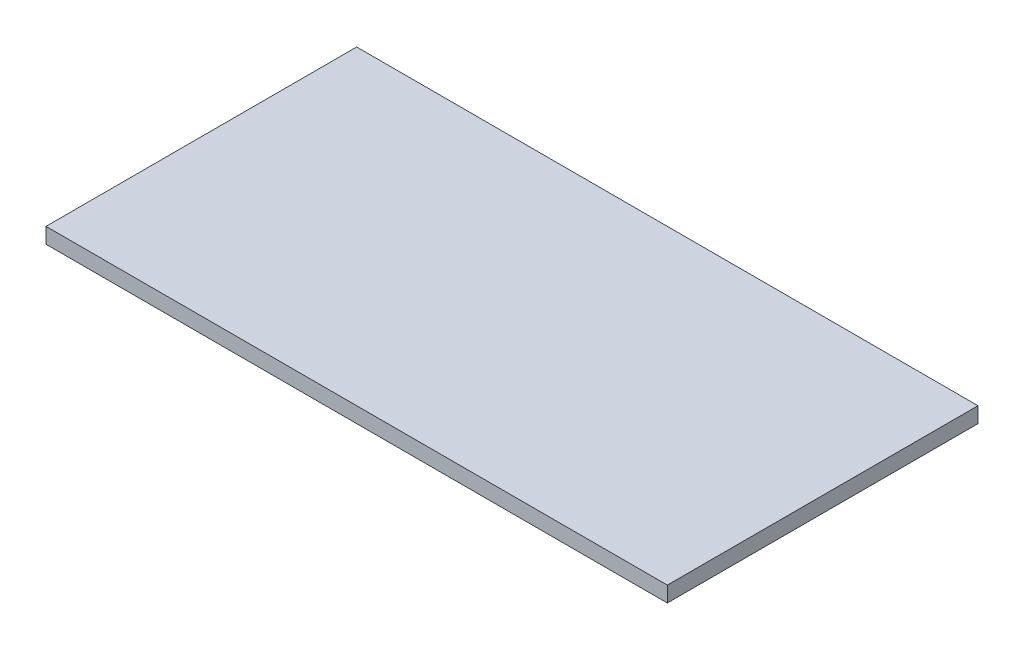
ISO-10303-21;
HEADER;
FILE_DESCRIPTION(('STEP AP214'),'2;1');
FILE_NAME('part.step','',(''),(''),'','','');
FILE_SCHEMA(('AUTOMOTIVE_DESIGN { 1 0 10303 214 1 1 1 1 }'));
ENDSEC;
DATA;
#1=APPLICATION_CONTEXT('core data for automotive mechanical design processes');
#2=APPLICATION_PROTOCOL_DEFINITION('international standard','automotive_design',2000,#1);
#3=PRODUCT_CONTEXT('',#1,'mechanical');
#4=PRODUCT('Part','Part','',(#3));
#5=PRODUCT_RELATED_PRODUCT_CATEGORY('part','',(#4));
#6=PRODUCT_DEFINITION_FORMATION('','',#4);
#7=PRODUCT_DEFINITION_CONTEXT('part definition',#1,'design');
#8=PRODUCT_DEFINITION('design','',#6,#7);
#9=PRODUCT_DEFINITION_SHAPE('','',#8);
#10=(LENGTH_UNIT() NAMED_UNIT(*) SI_UNIT(.MILLI.,.METRE.));
#11=(NAMED_UNIT(*) PLANE_ANGLE_UNIT() SI_UNIT($,.RADIAN.));
#12=(NAMED_UNIT(*) SI_UNIT($,.STERADIAN.) SOLID_ANGLE_UNIT());
#13=UNCERTAINTY_MEASURE_WITH_UNIT(LENGTH_MEASURE(1.E-05),#10,'distance_accuracy_value','');
#14=(GEOMETRIC_REPRESENTATION_CONTEXT(3) GLOBAL_UNCERTAINTY_ASSIGNED_CONTEXT((#13)) GLOBAL_UNIT_ASSIGNED_CONTEXT((#10,
#11,#12)) REPRESENTATION_CONTEXT('',''));
#15=CARTESIAN_POINT('',(0.,0.,0.));
#16=DIRECTION('',(0.,0.,1.));
#17=DIRECTION('',(1.,0.,0.));
#18=AXIS2_PLACEMENT_3D('',#15,#16,#17);
#19=CARTESIAN_POINT('',(0.,6.35,0.));
#20=DIRECTION('',(1.,0.,0.));
#21=DIRECTION('',(0.,0.,-1.));
#22=AXIS2_PLACEMENT_3D('',#19,#20,#21);
#23=PLANE('',#22);
#24=DIRECTION('',(0.,0.,1.));
#25=VECTOR('',#24,1.);
#26=CARTESIAN_POINT('',(0.,0.,0.));
#27=LINE('',#26,#25);
#28=CARTESIAN_POINT('',(0.,0.,-127.));
#29=VERTEX_POINT('',#28);
#30=CARTESIAN_POINT('',(0.,0.,0.));
#31=VERTEX_POINT('',#30);
#32=EDGE_CURVE('E96',#29,#31,#27,.T.);
#33=ORIENTED_EDGE('',*,*,#32,.T.);
#34=DIRECTION('',(0.,-1.,0.));
#35=VECTOR('',#34,1.);
#36=CARTESIAN_POINT('',(0.,6.35,0.));
#37=LINE('',#36,#35);
#38=CARTESIAN_POINT('',(0.,6.35,0.));
#39=VERTEX_POINT('',#38);
#40=EDGE_CURVE('E11',#39,#31,#37,.T.);
#41=ORIENTED_EDGE('',*,*,#40,.F.);
#42=DIRECTION('',(0.,0.,1.));
#43=VECTOR('',#42,1.);
#44=CARTESIAN_POINT('',(0.,6.35,0.));
#45=LINE('',#44,#43);
#46=CARTESIAN_POINT('',(0.,6.35,-127.));
#47=VERTEX_POINT('',#46);
#48=EDGE_CURVE('E84',#47,#39,#45,.T.);
#49=ORIENTED_EDGE('',*,*,#48,.F.);
#50=DIRECTION('',(0.,-1.,0.));
#51=VECTOR('',#50,1.);
#52=CARTESIAN_POINT('',(0.,6.35,-127.));
#53=LINE('',#52,#51);
#54=EDGE_CURVE('E92',#47,#29,#53,.T.);
#55=ORIENTED_EDGE('',*,*,#54,.T.);
#56=EDGE_LOOP('',(#33,#41,#49,#55));
#57=FACE_BOUND('',#56,.T.);
#58=ADVANCED_FACE('F33',(#57),#23,.F.);
#59=CARTESIAN_POINT('',(0.,6.35,0.));
#60=DIRECTION('',(0.,0.,-1.));
#61=DIRECTION('',(-1.,0.,0.));
#62=AXIS2_PLACEMENT_3D('',#59,#60,#61);
#63=PLANE('',#62);
#64=DIRECTION('',(1.,0.,0.));
#65=VECTOR('',#64,1.);
#66=CARTESIAN_POINT('',(0.,0.,0.));
#67=LINE('',#66,#65);
#68=CARTESIAN_POINT('',(254.,0.,0.));
#69=VERTEX_POINT('',#68);
#70=EDGE_CURVE('E88',#31,#69,#67,.T.);
#71=ORIENTED_EDGE('',*,*,#70,.T.);
#72=DIRECTION('',(0.,-1.,0.));
#73=VECTOR('',#72,1.);
#74=CARTESIAN_POINT('',(254.,6.35,0.));
#75=LINE('',#74,#73);
#76=CARTESIAN_POINT('',(254.,6.35,0.));
#77=VERTEX_POINT('',#76);
#78=EDGE_CURVE('E41',#77,#69,#75,.T.);
#79=ORIENTED_EDGE('',*,*,#78,.F.);
#80=DIRECTION('',(1.,0.,0.));
#81=VECTOR('',#80,1.);
#82=CARTESIAN_POINT('',(0.,6.35,0.));
#83=LINE('',#82,#81);
#84=EDGE_CURVE('E79',#39,#77,#83,.T.);
#85=ORIENTED_EDGE('',*,*,#84,.F.);
#86=ORIENTED_EDGE('',*,*,#40,.T.);
#87=EDGE_LOOP('',(#71,#79,#85,#86));
#88=FACE_BOUND('',#87,.T.);
#89=ADVANCED_FACE('F87',(#88),#63,.F.);
#90=CARTESIAN_POINT('',(254.,6.35,0.));
#91=DIRECTION('',(-1.,0.,0.));
#92=DIRECTION('',(0.,0.,1.));
#93=AXIS2_PLACEMENT_3D('',#90,#91,#92);
#94=PLANE('',#93);
#95=DIRECTION('',(0.,0.,-1.));
#96=VECTOR('',#95,1.);
#97=CARTESIAN_POINT('',(254.,0.,0.));
#98=LINE('',#97,#96);
#99=CARTESIAN_POINT('',(254.,0.,-127.));
#100=VERTEX_POINT('',#99);
#101=EDGE_CURVE('E66',#69,#100,#98,.T.);
#102=ORIENTED_EDGE('',*,*,#101,.T.);
#103=DIRECTION('',(0.,-1.,0.));
#104=VECTOR('',#103,1.);
#105=CARTESIAN_POINT('',(254.,6.35,-127.));
#106=LINE('',#105,#104);
#107=CARTESIAN_POINT('',(254.,6.35,-127.));
#108=VERTEX_POINT('',#107);
#109=EDGE_CURVE('E89',#108,#100,#106,.T.);
#110=ORIENTED_EDGE('',*,*,#109,.F.);
#111=DIRECTION('',(0.,0.,-1.));
#112=VECTOR('',#111,1.);
#113=CARTESIAN_POINT('',(254.,6.35,0.));
#114=LINE('',#113,#112);
#115=EDGE_CURVE('E82',#77,#108,#114,.T.);
#116=ORIENTED_EDGE('',*,*,#115,.F.);
#117=ORIENTED_EDGE('',*,*,#78,.T.);
#118=EDGE_LOOP('',(#102,#110,#116,#117));
#119=FACE_BOUND('',#118,.T.);
#120=ADVANCED_FACE('F90',(#119),#94,.F.);
#121=CARTESIAN_POINT('',(0.,6.35,-127.));
#122=DIRECTION('',(0.,0.,1.));
#123=DIRECTION('',(1.,0.,0.));
#124=AXIS2_PLACEMENT_3D('',#121,#122,#123);
#125=PLANE('',#124);
#126=DIRECTION('',(-1.,0.,0.));
#127=VECTOR('',#126,1.);
#128=CARTESIAN_POINT('',(0.,0.,-127.));
#129=LINE('',#128,#127);
#130=EDGE_CURVE('E72',#100,#29,#129,.T.);
#131=ORIENTED_EDGE('',*,*,#130,.T.);
#132=ORIENTED_EDGE('',*,*,#54,.F.);
#133=DIRECTION('',(-1.,0.,0.));
#134=VECTOR('',#133,1.);
#135=CARTESIAN_POINT('',(0.,6.35,-127.));
#136=LINE('',#135,#134);
#137=EDGE_CURVE('E49',#108,#47,#136,.T.);
#138=ORIENTED_EDGE('',*,*,#137,.F.);
#139=ORIENTED_EDGE('',*,*,#109,.T.);
#140=EDGE_LOOP('',(#131,#132,#138,#139));
#141=FACE_BOUND('',#140,.T.);
#142=ADVANCED_FACE('F103',(#141),#125,.F.);
#143=CARTESIAN_POINT('',(0.,6.35,0.));
#144=DIRECTION('',(0.,-1.,0.));
#145=DIRECTION('',(0.,0.,-1.));
#146=AXIS2_PLACEMENT_3D('',#143,#144,#145);
#147=PLANE('',#146);
#148=ORIENTED_EDGE('',*,*,#48,.T.);
#149=ORIENTED_EDGE('',*,*,#84,.T.);
#150=ORIENTED_EDGE('',*,*,#115,.T.);
#151=ORIENTED_EDGE('',*,*,#137,.T.);
#152=EDGE_LOOP('',(#148,#149,#150,#151));
#153=FACE_BOUND('',#152,.T.);
#154=ADVANCED_FACE('F80',(#153),#147,.F.);
#155=CARTESIAN_POINT('',(0.,0.,0.));
#156=DIRECTION('',(0.,-1.,0.));
#157=DIRECTION('',(0.,0.,-1.));
#158=AXIS2_PLACEMENT_3D('',#155,#156,#157);
#159=PLANE('',#158);
#160=ORIENTED_EDGE('',*,*,#32,.F.);
#161=ORIENTED_EDGE('',*,*,#130,.F.);
#162=ORIENTED_EDGE('',*,*,#101,.F.);
#163=ORIENTED_EDGE('',*,*,#70,.F.);
#164=EDGE_LOOP('',(#160,#161,#162,#163));
#165=FACE_BOUND('',#164,.T.);
#166=ADVANCED_FACE('F106',(#165),#159,.T.);
#167=CLOSED_SHELL('',(#58,#89,#120,#142,#154,#166));
#168=MANIFOLD_SOLID_BREP('B2',#167);
#169=ADVANCED_BREP_SHAPE_REPRESENTATION('',(#18,#168),#14);
#170=SHAPE_DEFINITION_REPRESENTATION(#9,#169);
ENDSEC;
END-ISO-10303-21;
